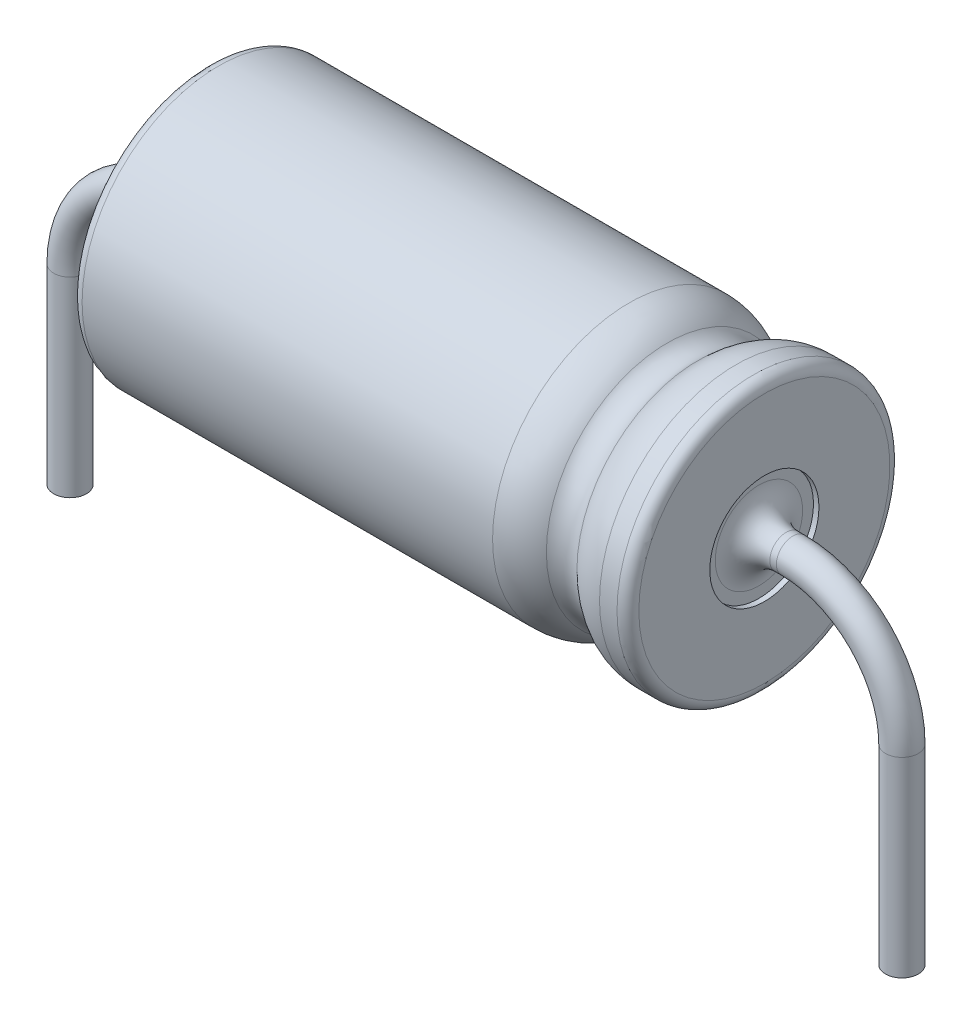
ISO-10303-21;
HEADER;
FILE_DESCRIPTION(('STEP AP214'),'2;1');
FILE_NAME('part.step','',(''),(''),'','','');
FILE_SCHEMA(('AUTOMOTIVE_DESIGN { 1 0 10303 214 1 1 1 1 }'));
ENDSEC;
DATA;
#1=APPLICATION_CONTEXT('core data for automotive mechanical design processes');
#2=APPLICATION_PROTOCOL_DEFINITION('international standard','automotive_design',2000,#1);
#3=PRODUCT_CONTEXT('',#1,'mechanical');
#4=PRODUCT('Part','Part','',(#3));
#5=PRODUCT_RELATED_PRODUCT_CATEGORY('part','',(#4));
#6=PRODUCT_DEFINITION_FORMATION('','',#4);
#7=PRODUCT_DEFINITION_CONTEXT('part definition',#1,'design');
#8=PRODUCT_DEFINITION('design','',#6,#7);
#9=PRODUCT_DEFINITION_SHAPE('','',#8);
#10=(LENGTH_UNIT() NAMED_UNIT(*) SI_UNIT(.MILLI.,.METRE.));
#11=(NAMED_UNIT(*) PLANE_ANGLE_UNIT() SI_UNIT($,.RADIAN.));
#12=(NAMED_UNIT(*) SI_UNIT($,.STERADIAN.) SOLID_ANGLE_UNIT());
#13=UNCERTAINTY_MEASURE_WITH_UNIT(LENGTH_MEASURE(1.E-05),#10,'distance_accuracy_value','');
#14=(GEOMETRIC_REPRESENTATION_CONTEXT(3) GLOBAL_UNCERTAINTY_ASSIGNED_CONTEXT((#13)) GLOBAL_UNIT_ASSIGNED_CONTEXT((#10,
#11,#12)) REPRESENTATION_CONTEXT('',''));
#15=CARTESIAN_POINT('',(0.,0.,0.));
#16=DIRECTION('',(0.,0.,1.));
#17=DIRECTION('',(1.,0.,0.));
#18=AXIS2_PLACEMENT_3D('',#15,#16,#17);
#19=CARTESIAN_POINT('',(-2.52,2.5,0.));
#20=DIRECTION('',(1.,0.,0.));
#21=DIRECTION('',(0.,0.,-1.));
#22=AXIS2_PLACEMENT_3D('',#19,#20,#21);
#23=CYLINDRICAL_SURFACE('',#22,2.5);
#24=CARTESIAN_POINT('',(-12.52,2.5,0.));
#25=DIRECTION('',(1.,0.,0.));
#26=DIRECTION('',(0.,0.,-1.));
#27=AXIS2_PLACEMENT_3D('',#24,#25,#26);
#28=CIRCLE('',#27,2.5);
#29=CARTESIAN_POINT('',(-12.52,2.5,-2.5));
#30=VERTEX_POINT('',#29);
#31=EDGE_CURVE('E62',#30,#30,#28,.T.);
#32=ORIENTED_EDGE('',*,*,#31,.T.);
#33=EDGE_LOOP('',(#32));
#34=FACE_BOUND('',#33,.T.);
#35=CARTESIAN_POINT('',(-4.99983705711194,2.5,0.));
#36=DIRECTION('',(1.,0.,0.));
#37=DIRECTION('',(0.,0.,-1.));
#38=AXIS2_PLACEMENT_3D('',#35,#36,#37);
#39=CIRCLE('',#38,2.5);
#40=CARTESIAN_POINT('',(-4.99983705711194,2.5,-2.5));
#41=VERTEX_POINT('',#40);
#42=EDGE_CURVE('E114',#41,#41,#39,.T.);
#43=ORIENTED_EDGE('',*,*,#42,.F.);
#44=EDGE_LOOP('',(#43));
#45=FACE_BOUND('',#44,.T.);
#46=ADVANCED_FACE('F30',(#34,#45),#23,.T.);
#47=CARTESIAN_POINT('',(-12.62,2.5,0.));
#48=DIRECTION('',(-1.,0.,0.));
#49=DIRECTION('',(0.,-1.,0.));
#50=AXIS2_PLACEMENT_3D('',#47,#48,#49);
#51=PLANE('',#50);
#52=CARTESIAN_POINT('',(-12.62,2.5,0.));
#53=DIRECTION('',(-1.,0.,0.));
#54=DIRECTION('',(0.,-1.,0.));
#55=AXIS2_PLACEMENT_3D('',#52,#53,#54);
#56=CIRCLE('',#55,0.8);
#57=CARTESIAN_POINT('',(-12.62,1.7,0.));
#58=VERTEX_POINT('',#57);
#59=EDGE_CURVE('E46',#58,#58,#56,.F.);
#60=ORIENTED_EDGE('',*,*,#59,.T.);
#61=EDGE_LOOP('',(#60));
#62=FACE_BOUND('',#61,.T.);
#63=CARTESIAN_POINT('',(-12.62,2.5,0.));
#64=DIRECTION('',(-1.,0.,0.));
#65=DIRECTION('',(0.,-1.,0.));
#66=AXIS2_PLACEMENT_3D('',#63,#64,#65);
#67=CIRCLE('',#66,1.);
#68=CARTESIAN_POINT('',(-12.62,1.5,0.));
#69=VERTEX_POINT('',#68);
#70=EDGE_CURVE('E78',#69,#69,#67,.T.);
#71=ORIENTED_EDGE('',*,*,#70,.T.);
#72=EDGE_LOOP('',(#71));
#73=FACE_BOUND('',#72,.T.);
#74=ADVANCED_FACE('F121',(#62,#73),#51,.T.);
#75=CARTESIAN_POINT('',(-12.72,5.,0.));
#76=DIRECTION('',(1.,0.,0.));
#77=DIRECTION('',(0.,0.,-1.));
#78=AXIS2_PLACEMENT_3D('',#75,#76,#77);
#79=PLANE('',#78);
#80=CARTESIAN_POINT('',(-12.72,2.5,0.));
#81=DIRECTION('',(1.,0.,0.));
#82=DIRECTION('',(0.,0.,-1.));
#83=AXIS2_PLACEMENT_3D('',#80,#81,#82);
#84=CIRCLE('',#83,2.3);
#85=CARTESIAN_POINT('',(-12.72,2.5,-2.3));
#86=VERTEX_POINT('',#85);
#87=EDGE_CURVE('E51',#86,#86,#84,.F.);
#88=ORIENTED_EDGE('',*,*,#87,.T.);
#89=EDGE_LOOP('',(#88));
#90=FACE_BOUND('',#89,.T.);
#91=CARTESIAN_POINT('',(-12.72,2.5,0.));
#92=DIRECTION('',(-1.,0.,0.));
#93=DIRECTION('',(0.,-1.,0.));
#94=AXIS2_PLACEMENT_3D('',#91,#92,#93);
#95=CIRCLE('',#94,1.);
#96=CARTESIAN_POINT('',(-12.72,1.5,0.));
#97=VERTEX_POINT('',#96);
#98=EDGE_CURVE('E81',#97,#97,#95,.T.);
#99=ORIENTED_EDGE('',*,*,#98,.F.);
#100=EDGE_LOOP('',(#99));
#101=FACE_BOUND('',#100,.T.);
#102=ADVANCED_FACE('F128',(#90,#101),#79,.F.);
#103=CARTESIAN_POINT('',(-12.62,2.5,0.));
#104=DIRECTION('',(-1.,0.,0.));
#105=DIRECTION('',(0.,-1.,0.));
#106=AXIS2_PLACEMENT_3D('',#103,#104,#105);
#107=CYLINDRICAL_SURFACE('',#106,1.);
#108=ORIENTED_EDGE('',*,*,#70,.F.);
#109=EDGE_LOOP('',(#108));
#110=FACE_BOUND('',#109,.T.);
#111=ORIENTED_EDGE('',*,*,#98,.T.);
#112=EDGE_LOOP('',(#111));
#113=FACE_BOUND('',#112,.T.);
#114=ADVANCED_FACE('F164',(#110,#113),#107,.F.);
#115=CARTESIAN_POINT('',(-12.52,2.5,0.));
#116=DIRECTION('',(1.,0.,0.));
#117=DIRECTION('',(0.,0.,-1.));
#118=AXIS2_PLACEMENT_3D('',#115,#116,#117);
#119=TOROIDAL_SURFACE('',#118,2.3,0.2);
#120=ORIENTED_EDGE('',*,*,#87,.F.);
#121=EDGE_LOOP('',(#120));
#122=FACE_BOUND('',#121,.T.);
#123=ORIENTED_EDGE('',*,*,#31,.F.);
#124=EDGE_LOOP('',(#123));
#125=FACE_BOUND('',#124,.T.);
#126=ADVANCED_FACE('F166',(#122,#125),#119,.T.);
#127=CARTESIAN_POINT('',(-2.00000000000002,2.5,0.));
#128=DIRECTION('',(-1.,0.,0.));
#129=DIRECTION('',(0.,-1.,0.));
#130=AXIS2_PLACEMENT_3D('',#127,#128,#129);
#131=CYLINDRICAL_SURFACE('',#130,0.3);
#132=CARTESIAN_POINT('',(-13.12,2.5,0.));
#133=DIRECTION('',(-1.,0.,0.));
#134=DIRECTION('',(0.,-1.,0.));
#135=AXIS2_PLACEMENT_3D('',#132,#133,#134);
#136=CIRCLE('',#135,0.3);
#137=CARTESIAN_POINT('',(-13.12,2.2,0.));
#138=VERTEX_POINT('',#137);
#139=EDGE_CURVE('E42',#138,#138,#136,.T.);
#140=ORIENTED_EDGE('',*,*,#139,.T.);
#141=EDGE_LOOP('',(#140));
#142=FACE_BOUND('',#141,.T.);
#143=CARTESIAN_POINT('',(-13.24,2.5,0.));
#144=DIRECTION('',(1.,0.,0.));
#145=DIRECTION('',(0.,1.,0.));
#146=AXIS2_PLACEMENT_3D('',#143,#144,#145);
#147=CIRCLE('',#146,0.3);
#148=CARTESIAN_POINT('',(-13.24,2.8,0.));
#149=VERTEX_POINT('',#148);
#150=EDGE_CURVE('E102',#149,#149,#147,.T.);
#151=ORIENTED_EDGE('',*,*,#150,.T.);
#152=EDGE_LOOP('',(#151));
#153=FACE_BOUND('',#152,.T.);
#154=ADVANCED_FACE('F175',(#142,#153),#131,.T.);
#155=CARTESIAN_POINT('',(-13.12,2.5,0.));
#156=DIRECTION('',(-1.,0.,0.));
#157=DIRECTION('',(0.,-1.,0.));
#158=AXIS2_PLACEMENT_3D('',#155,#156,#157);
#159=TOROIDAL_SURFACE('',#158,0.8,0.5);
#160=ORIENTED_EDGE('',*,*,#139,.F.);
#161=EDGE_LOOP('',(#160));
#162=FACE_BOUND('',#161,.T.);
#163=ORIENTED_EDGE('',*,*,#59,.F.);
#164=EDGE_LOOP('',(#163));
#165=FACE_BOUND('',#164,.T.);
#166=ADVANCED_FACE('F194',(#162,#165),#159,.F.);
#167=CARTESIAN_POINT('',(-15.24,0.49999999999998,0.));
#168=DIRECTION('',(0.,-1.,0.));
#169=DIRECTION('',(0.,0.,-1.));
#170=AXIS2_PLACEMENT_3D('',#167,#168,#169);
#171=CYLINDRICAL_SURFACE('',#170,0.3);
#172=CARTESIAN_POINT('',(-15.24,0.49999999999998,0.));
#173=DIRECTION('',(0.,1.,0.));
#174=DIRECTION('',(-1.,0.,0.));
#175=AXIS2_PLACEMENT_3D('',#172,#173,#174);
#176=CIRCLE('',#175,0.3);
#177=CARTESIAN_POINT('',(-15.54,0.499999999999977,0.));
#178=VERTEX_POINT('',#177);
#179=EDGE_CURVE('E99',#178,#178,#176,.T.);
#180=ORIENTED_EDGE('',*,*,#179,.F.);
#181=EDGE_LOOP('',(#180));
#182=FACE_BOUND('',#181,.T.);
#183=CARTESIAN_POINT('',(-15.24,-3.00000000000002,0.));
#184=DIRECTION('',(0.,1.,0.));
#185=DIRECTION('',(-1.,0.,0.));
#186=AXIS2_PLACEMENT_3D('',#183,#184,#185);
#187=CIRCLE('',#186,0.3);
#188=CARTESIAN_POINT('',(-15.54,-3.00000000000003,0.));
#189=VERTEX_POINT('',#188);
#190=EDGE_CURVE('E96',#189,#189,#187,.T.);
#191=ORIENTED_EDGE('',*,*,#190,.T.);
#192=EDGE_LOOP('',(#191));
#193=FACE_BOUND('',#192,.T.);
#194=ADVANCED_FACE('F190',(#182,#193),#171,.T.);
#195=CARTESIAN_POINT('',(-13.24,0.5,0.));
#196=DIRECTION('',(0.,0.,-1.));
#197=DIRECTION('',(-1.,0.,0.));
#198=AXIS2_PLACEMENT_3D('',#195,#196,#197);
#199=TOROIDAL_SURFACE('',#198,2.,0.3);
#200=CARTESIAN_POINT('',(-13.24,0.5,0.));
#201=DIRECTION('',(0.,0.,-1.));
#202=DIRECTION('',(-1.,0.,0.));
#203=AXIS2_PLACEMENT_3D('',#200,#201,#202);
#204=CIRCLE('',#203,2.3);
#205=EDGE_CURVE('',#178,#149,#204,.T.);
#206=ORIENTED_EDGE('',*,*,#179,.T.);
#207=ORIENTED_EDGE('',*,*,#150,.F.);
#208=ORIENTED_EDGE('',*,*,#205,.T.);
#209=ORIENTED_EDGE('',*,*,#205,.F.);
#210=EDGE_LOOP('',(#206,#208,#207,#209));
#211=FACE_BOUND('',#210,.T.);
#212=ADVANCED_FACE('F193',(#211),#199,.T.);
#213=CARTESIAN_POINT('',(-15.24,-3.00000000000002,0.));
#214=DIRECTION('',(0.,-1.,0.));
#215=DIRECTION('',(-1.,0.,0.));
#216=AXIS2_PLACEMENT_3D('',#213,#214,#215);
#217=PLANE('',#216);
#218=ORIENTED_EDGE('',*,*,#190,.F.);
#219=EDGE_LOOP('',(#218));
#220=FACE_BOUND('',#219,.T.);
#221=ADVANCED_FACE('F196',(#220),#217,.T.);
#222=CARTESIAN_POINT('',(-4.99983705711194,2.5,0.));
#223=DIRECTION('',(1.,0.,0.));
#224=DIRECTION('',(0.,0.,-1.));
#225=AXIS2_PLACEMENT_3D('',#222,#223,#224);
#226=TOROIDAL_SURFACE('',#225,1.5,1.);
#227=CARTESIAN_POINT('',(-4.29998313649422,2.5,0.));
#228=DIRECTION('',(1.,0.,0.));
#229=DIRECTION('',(0.,0.,-1.));
#230=AXIS2_PLACEMENT_3D('',#227,#228,#229);
#231=CIRCLE('',#230,2.214286);
#232=CARTESIAN_POINT('',(-4.29998313649422,2.5,-2.214286));
#233=VERTEX_POINT('',#232);
#234=EDGE_CURVE('E105',#233,#233,#231,.T.);
#235=ORIENTED_EDGE('',*,*,#234,.F.);
#236=EDGE_LOOP('',(#235));
#237=FACE_BOUND('',#236,.T.);
#238=ORIENTED_EDGE('',*,*,#42,.T.);
#239=EDGE_LOOP('',(#238));
#240=FACE_BOUND('',#239,.T.);
#241=ADVANCED_FACE('F118',(#237,#240),#226,.T.);
#242=CARTESIAN_POINT('',(-4.02004156824713,2.5,0.));
#243=DIRECTION('',(1.,0.,0.));
#244=DIRECTION('',(0.,0.,-1.));
#245=AXIS2_PLACEMENT_3D('',#242,#243,#244);
#246=TOROIDAL_SURFACE('',#245,2.5000004,0.399999999999999);
#247=CARTESIAN_POINT('',(-3.74010000000004,2.5,0.));
#248=DIRECTION('',(1.,0.,0.));
#249=DIRECTION('',(0.,0.,-1.));
#250=AXIS2_PLACEMENT_3D('',#247,#248,#249);
#251=CIRCLE('',#250,2.214286);
#252=CARTESIAN_POINT('',(-3.74010000000004,2.5,-2.214286));
#253=VERTEX_POINT('',#252);
#254=EDGE_CURVE('E108',#253,#253,#251,.T.);
#255=ORIENTED_EDGE('',*,*,#254,.F.);
#256=EDGE_LOOP('',(#255));
#257=FACE_BOUND('',#256,.T.);
#258=ORIENTED_EDGE('',*,*,#234,.T.);
#259=EDGE_LOOP('',(#258));
#260=FACE_BOUND('',#259,.T.);
#261=ADVANCED_FACE('F205',(#257,#260),#246,.F.);
#262=CARTESIAN_POINT('',(-3.04024607938231,2.5,0.));
#263=DIRECTION('',(1.,0.,0.));
#264=DIRECTION('',(0.,0.,-1.));
#265=AXIS2_PLACEMENT_3D('',#262,#263,#264);
#266=TOROIDAL_SURFACE('',#265,1.5,1.);
#267=CARTESIAN_POINT('',(-3.04024607938231,2.5,0.));
#268=DIRECTION('',(1.,0.,0.));
#269=DIRECTION('',(0.,0.,-1.));
#270=AXIS2_PLACEMENT_3D('',#267,#268,#269);
#271=CIRCLE('',#270,2.5);
#272=CARTESIAN_POINT('',(-3.04024607938231,2.5,-2.5));
#273=VERTEX_POINT('',#272);
#274=EDGE_CURVE('E111',#273,#273,#271,.T.);
#275=ORIENTED_EDGE('',*,*,#274,.F.);
#276=EDGE_LOOP('',(#275));
#277=FACE_BOUND('',#276,.T.);
#278=ORIENTED_EDGE('',*,*,#254,.T.);
#279=EDGE_LOOP('',(#278));
#280=FACE_BOUND('',#279,.T.);
#281=ADVANCED_FACE('F188',(#277,#280),#266,.T.);
#282=CARTESIAN_POINT('',(0.,-3.00000000000002,0.));
#283=DIRECTION('',(0.,-1.,0.));
#284=DIRECTION('',(1.,0.,0.));
#285=AXIS2_PLACEMENT_3D('',#282,#283,#284);
#286=PLANE('',#285);
#287=CARTESIAN_POINT('',(0.,-3.00000000000002,0.));
#288=DIRECTION('',(0.,-1.,0.));
#289=DIRECTION('',(1.,0.,0.));
#290=AXIS2_PLACEMENT_3D('',#287,#288,#289);
#291=CIRCLE('',#290,0.3);
#292=CARTESIAN_POINT('',(0.3,-3.00000000000003,0.));
#293=VERTEX_POINT('',#292);
#294=EDGE_CURVE('E90',#293,#293,#291,.T.);
#295=ORIENTED_EDGE('',*,*,#294,.T.);
#296=EDGE_LOOP('',(#295));
#297=FACE_BOUND('',#296,.T.);
#298=ADVANCED_FACE('F181',(#297),#286,.T.);
#299=CARTESIAN_POINT('',(0.,0.49999999999998,0.));
#300=DIRECTION('',(0.,-1.,0.));
#301=DIRECTION('',(0.,0.,-1.));
#302=AXIS2_PLACEMENT_3D('',#299,#300,#301);
#303=CYLINDRICAL_SURFACE('',#302,0.3);
#304=CARTESIAN_POINT('',(0.,0.49999999999998,0.));
#305=DIRECTION('',(0.,-1.,0.));
#306=DIRECTION('',(1.,0.,0.));
#307=AXIS2_PLACEMENT_3D('',#304,#305,#306);
#308=CIRCLE('',#307,0.3);
#309=CARTESIAN_POINT('',(0.3,0.499999999999977,0.));
#310=VERTEX_POINT('',#309);
#311=EDGE_CURVE('E93',#310,#310,#308,.T.);
#312=ORIENTED_EDGE('',*,*,#311,.T.);
#313=EDGE_LOOP('',(#312));
#314=FACE_BOUND('',#313,.T.);
#315=ORIENTED_EDGE('',*,*,#294,.F.);
#316=EDGE_LOOP('',(#315));
#317=FACE_BOUND('',#316,.T.);
#318=ADVANCED_FACE('F177',(#314,#317),#303,.T.);
#319=CARTESIAN_POINT('',(-2.,0.5,0.));
#320=DIRECTION('',(0.,0.,1.));
#321=DIRECTION('',(1.,0.,0.));
#322=AXIS2_PLACEMENT_3D('',#319,#320,#321);
#323=TOROIDAL_SURFACE('',#322,2.,0.3);
#324=CARTESIAN_POINT('',(-2.00000000000002,2.5,0.));
#325=DIRECTION('',(1.,0.,0.));
#326=DIRECTION('',(0.,1.,0.));
#327=AXIS2_PLACEMENT_3D('',#324,#325,#326);
#328=CIRCLE('',#327,0.3);
#329=CARTESIAN_POINT('',(-2.00000000000002,2.8,0.));
#330=VERTEX_POINT('',#329);
#331=EDGE_CURVE('E56',#330,#330,#328,.T.);
#332=CARTESIAN_POINT('',(-2.,0.5,0.));
#333=DIRECTION('',(0.,0.,1.));
#334=DIRECTION('',(1.,0.,0.));
#335=AXIS2_PLACEMENT_3D('',#332,#333,#334);
#336=CIRCLE('',#335,2.3);
#337=EDGE_CURVE('',#310,#330,#336,.T.);
#338=ORIENTED_EDGE('',*,*,#311,.F.);
#339=ORIENTED_EDGE('',*,*,#331,.T.);
#340=ORIENTED_EDGE('',*,*,#337,.T.);
#341=ORIENTED_EDGE('',*,*,#337,.F.);
#342=EDGE_LOOP('',(#338,#340,#339,#341));
#343=FACE_BOUND('',#342,.T.);
#344=ADVANCED_FACE('F180',(#343),#323,.T.);
#345=CARTESIAN_POINT('',(-2.12000000000002,2.5,0.));
#346=DIRECTION('',(1.,0.,0.));
#347=DIRECTION('',(0.,0.,-1.));
#348=AXIS2_PLACEMENT_3D('',#345,#346,#347);
#349=CIRCLE('',#348,0.3);
#350=CARTESIAN_POINT('',(-2.12000000000002,2.5,-0.3));
#351=VERTEX_POINT('',#350);
#352=EDGE_CURVE('E10',#351,#351,#349,.T.);
#353=ORIENTED_EDGE('',*,*,#352,.T.);
#354=EDGE_LOOP('',(#353));
#355=FACE_BOUND('',#354,.T.);
#356=ORIENTED_EDGE('',*,*,#331,.F.);
#357=EDGE_LOOP('',(#356));
#358=FACE_BOUND('',#357,.T.);
#359=ADVANCED_FACE('F174',(#355,#358),#131,.T.);
#360=CARTESIAN_POINT('',(-2.12000000000002,2.5,0.));
#361=DIRECTION('',(1.,0.,0.));
#362=DIRECTION('',(0.,0.,-1.));
#363=AXIS2_PLACEMENT_3D('',#360,#361,#362);
#364=TOROIDAL_SURFACE('',#363,0.8,0.5);
#365=ORIENTED_EDGE('',*,*,#352,.F.);
#366=EDGE_LOOP('',(#365));
#367=FACE_BOUND('',#366,.T.);
#368=CARTESIAN_POINT('',(-2.62000000000002,2.5,0.));
#369=DIRECTION('',(1.,0.,0.));
#370=DIRECTION('',(0.,0.,-1.));
#371=AXIS2_PLACEMENT_3D('',#368,#369,#370);
#372=CIRCLE('',#371,0.8);
#373=CARTESIAN_POINT('',(-2.62000000000002,2.5,-0.8));
#374=VERTEX_POINT('',#373);
#375=EDGE_CURVE('E38',#374,#374,#372,.F.);
#376=ORIENTED_EDGE('',*,*,#375,.F.);
#377=EDGE_LOOP('',(#376));
#378=FACE_BOUND('',#377,.T.);
#379=ADVANCED_FACE('F32',(#367,#378),#364,.F.);
#380=CARTESIAN_POINT('',(-2.62000000000002,2.5,0.));
#381=DIRECTION('',(1.,0.,0.));
#382=DIRECTION('',(0.,0.,-1.));
#383=AXIS2_PLACEMENT_3D('',#380,#381,#382);
#384=PLANE('',#383);
#385=ORIENTED_EDGE('',*,*,#375,.T.);
#386=EDGE_LOOP('',(#385));
#387=FACE_BOUND('',#386,.T.);
#388=CARTESIAN_POINT('',(-2.62000000000002,2.5,0.));
#389=DIRECTION('',(1.,0.,0.));
#390=DIRECTION('',(0.,0.,-1.));
#391=AXIS2_PLACEMENT_3D('',#388,#389,#390);
#392=CIRCLE('',#391,1.);
#393=CARTESIAN_POINT('',(-2.62000000000002,2.5,-1.));
#394=VERTEX_POINT('',#393);
#395=EDGE_CURVE('E74',#394,#394,#392,.T.);
#396=ORIENTED_EDGE('',*,*,#395,.T.);
#397=EDGE_LOOP('',(#396));
#398=FACE_BOUND('',#397,.T.);
#399=ADVANCED_FACE('F155',(#387,#398),#384,.T.);
#400=CARTESIAN_POINT('',(-2.62000000000002,2.5,0.));
#401=DIRECTION('',(1.,0.,0.));
#402=DIRECTION('',(0.,0.,-1.));
#403=AXIS2_PLACEMENT_3D('',#400,#401,#402);
#404=CYLINDRICAL_SURFACE('',#403,1.);
#405=ORIENTED_EDGE('',*,*,#395,.F.);
#406=EDGE_LOOP('',(#405));
#407=FACE_BOUND('',#406,.T.);
#408=CARTESIAN_POINT('',(-2.52000000000002,2.5,0.));
#409=DIRECTION('',(1.,0.,0.));
#410=DIRECTION('',(0.,0.,-1.));
#411=AXIS2_PLACEMENT_3D('',#408,#409,#410);
#412=CIRCLE('',#411,1.);
#413=CARTESIAN_POINT('',(-2.52000000000002,2.5,-1.));
#414=VERTEX_POINT('',#413);
#415=EDGE_CURVE('E75',#414,#414,#412,.T.);
#416=ORIENTED_EDGE('',*,*,#415,.T.);
#417=EDGE_LOOP('',(#416));
#418=FACE_BOUND('',#417,.T.);
#419=ADVANCED_FACE('F151',(#407,#418),#404,.F.);
#420=CARTESIAN_POINT('',(-2.52000000000002,5.,0.));
#421=DIRECTION('',(-1.,0.,0.));
#422=DIRECTION('',(0.,0.,1.));
#423=AXIS2_PLACEMENT_3D('',#420,#421,#422);
#424=PLANE('',#423);
#425=CARTESIAN_POINT('',(-2.52000000000002,2.5,0.));
#426=DIRECTION('',(-1.,0.,0.));
#427=DIRECTION('',(0.,0.,1.));
#428=AXIS2_PLACEMENT_3D('',#425,#426,#427);
#429=CIRCLE('',#428,2.3);
#430=CARTESIAN_POINT('',(-2.52000000000002,2.5,2.3));
#431=VERTEX_POINT('',#430);
#432=EDGE_CURVE('E65',#431,#431,#429,.F.);
#433=ORIENTED_EDGE('',*,*,#432,.T.);
#434=EDGE_LOOP('',(#433));
#435=FACE_BOUND('',#434,.T.);
#436=ORIENTED_EDGE('',*,*,#415,.F.);
#437=EDGE_LOOP('',(#436));
#438=FACE_BOUND('',#437,.T.);
#439=ADVANCED_FACE('F140',(#435,#438),#424,.F.);
#440=CARTESIAN_POINT('',(-2.72000000000002,2.5,0.));
#441=DIRECTION('',(-1.,0.,0.));
#442=DIRECTION('',(0.,0.,1.));
#443=AXIS2_PLACEMENT_3D('',#440,#441,#442);
#444=TOROIDAL_SURFACE('',#443,2.3,0.2);
#445=CARTESIAN_POINT('',(-2.72000000000002,2.5,0.));
#446=DIRECTION('',(-1.,0.,0.));
#447=DIRECTION('',(0.,0.,1.));
#448=AXIS2_PLACEMENT_3D('',#445,#446,#447);
#449=CIRCLE('',#448,2.5);
#450=CARTESIAN_POINT('',(-2.72000000000002,2.5,2.5));
#451=VERTEX_POINT('',#450);
#452=EDGE_CURVE('E59',#451,#451,#449,.T.);
#453=ORIENTED_EDGE('',*,*,#452,.F.);
#454=EDGE_LOOP('',(#453));
#455=FACE_BOUND('',#454,.T.);
#456=ORIENTED_EDGE('',*,*,#432,.F.);
#457=EDGE_LOOP('',(#456));
#458=FACE_BOUND('',#457,.T.);
#459=ADVANCED_FACE('F134',(#455,#458),#444,.T.);
#460=ORIENTED_EDGE('',*,*,#274,.T.);
#461=EDGE_LOOP('',(#460));
#462=FACE_BOUND('',#461,.T.);
#463=ORIENTED_EDGE('',*,*,#452,.T.);
#464=EDGE_LOOP('',(#463));
#465=FACE_BOUND('',#464,.T.);
#466=ADVANCED_FACE('F124',(#462,#465),#23,.T.);
#467=CLOSED_SHELL('',(#46,#74,#102,#114,#126,#154,#166,#194,#212,#221,#241,#261,#281,#298,#318,
#344,#359,#379,#399,#419,#439,#459,#466));
#468=CARTESIAN_POINT('',(-3.52000000000001,4.99999999999998,0.));
#469=DIRECTION('',(-1.,0.,0.));
#470=DIRECTION('',(0.,0.,1.));
#471=AXIS2_PLACEMENT_3D('',#468,#469,#470);
#472=PLANE('',#471);
#473=CARTESIAN_POINT('',(-3.52000000000002,2.5,0.));
#474=DIRECTION('',(1.,0.,0.));
#475=DIRECTION('',(0.,0.,-1.));
#476=AXIS2_PLACEMENT_3D('',#473,#474,#475);
#477=CIRCLE('',#476,1.5);
#478=CARTESIAN_POINT('',(-3.52000000000002,2.5,-1.5));
#479=VERTEX_POINT('',#478);
#480=EDGE_CURVE('E68',#479,#479,#477,.T.);
#481=ORIENTED_EDGE('',*,*,#480,.F.);
#482=EDGE_LOOP('',(#481));
#483=FACE_BOUND('',#482,.T.);
#484=CARTESIAN_POINT('',(-3.52000000000001,2.5,0.));
#485=DIRECTION('',(-1.,0.,0.));
#486=DIRECTION('',(0.,0.,1.));
#487=AXIS2_PLACEMENT_3D('',#484,#485,#486);
#488=CIRCLE('',#487,0.3);
#489=CARTESIAN_POINT('',(-3.52000000000001,2.5,0.3));
#490=VERTEX_POINT('',#489);
#491=EDGE_CURVE('E55',#490,#490,#488,.F.);
#492=ORIENTED_EDGE('',*,*,#491,.T.);
#493=EDGE_LOOP('',(#492));
#494=FACE_BOUND('',#493,.T.);
#495=ADVANCED_FACE('F333',(#483,#494),#472,.T.);
#496=CARTESIAN_POINT('',(-11.72,5.,0.));
#497=DIRECTION('',(1.,0.,0.));
#498=DIRECTION('',(0.,0.,-1.));
#499=AXIS2_PLACEMENT_3D('',#496,#497,#498);
#500=PLANE('',#499);
#501=CARTESIAN_POINT('',(-11.72,2.5,0.));
#502=DIRECTION('',(1.,0.,0.));
#503=DIRECTION('',(0.,0.,-1.));
#504=AXIS2_PLACEMENT_3D('',#501,#502,#503);
#505=CIRCLE('',#504,1.5);
#506=CARTESIAN_POINT('',(-11.72,2.5,-1.5));
#507=VERTEX_POINT('',#506);
#508=EDGE_CURVE('E71',#507,#507,#505,.T.);
#509=ORIENTED_EDGE('',*,*,#508,.T.);
#510=EDGE_LOOP('',(#509));
#511=FACE_BOUND('',#510,.T.);
#512=CARTESIAN_POINT('',(-11.72,2.5,0.));
#513=DIRECTION('',(1.,0.,0.));
#514=DIRECTION('',(0.,0.,-1.));
#515=AXIS2_PLACEMENT_3D('',#512,#513,#514);
#516=CIRCLE('',#515,0.3);
#517=CARTESIAN_POINT('',(-11.72,2.5,-0.3));
#518=VERTEX_POINT('',#517);
#519=EDGE_CURVE('E52',#518,#518,#516,.F.);
#520=ORIENTED_EDGE('',*,*,#519,.T.);
#521=EDGE_LOOP('',(#520));
#522=FACE_BOUND('',#521,.T.);
#523=ADVANCED_FACE('F335',(#511,#522),#500,.T.);
#524=CARTESIAN_POINT('',(-2.52,2.5,0.));
#525=DIRECTION('',(1.,0.,0.));
#526=DIRECTION('',(0.,0.,-1.));
#527=AXIS2_PLACEMENT_3D('',#524,#525,#526);
#528=CYLINDRICAL_SURFACE('',#527,1.5);
#529=ORIENTED_EDGE('',*,*,#480,.T.);
#530=EDGE_LOOP('',(#529));
#531=FACE_BOUND('',#530,.T.);
#532=ORIENTED_EDGE('',*,*,#508,.F.);
#533=EDGE_LOOP('',(#532));
#534=FACE_BOUND('',#533,.T.);
#535=ADVANCED_FACE('F172',(#531,#534),#528,.F.);
#536=ORIENTED_EDGE('',*,*,#491,.F.);
#537=EDGE_LOOP('',(#536));
#538=FACE_BOUND('',#537,.T.);
#539=ORIENTED_EDGE('',*,*,#519,.F.);
#540=EDGE_LOOP('',(#539));
#541=FACE_BOUND('',#540,.T.);
#542=ADVANCED_FACE('F169',(#538,#541),#131,.T.);
#543=CLOSED_SHELL('',(#495,#523,#535,#542));
#544=ORIENTED_CLOSED_SHELL('',*,#543,.T.);
#545=BREP_WITH_VOIDS('B2',#467,(#544));
#546=ADVANCED_BREP_SHAPE_REPRESENTATION('',(#18,#545),#14);
#547=SHAPE_DEFINITION_REPRESENTATION(#9,#546);
ENDSEC;
END-ISO-10303-21;
